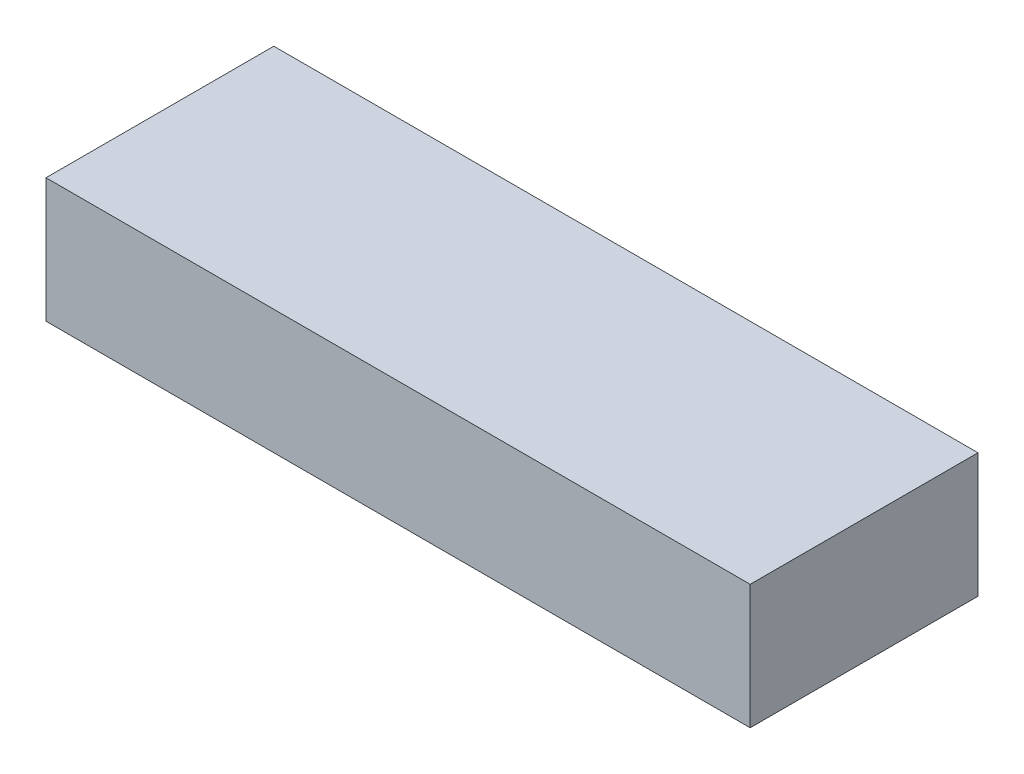
ISO-10303-21;
HEADER;
FILE_DESCRIPTION(('STEP AP214'),'2;1');
FILE_NAME('part.step','',(''),(''),'','','');
FILE_SCHEMA(('AUTOMOTIVE_DESIGN { 1 0 10303 214 1 1 1 1 }'));
ENDSEC;
DATA;
#1=APPLICATION_CONTEXT('core data for automotive mechanical design processes');
#2=APPLICATION_PROTOCOL_DEFINITION('international standard','automotive_design',2000,#1);
#3=PRODUCT_CONTEXT('',#1,'mechanical');
#4=PRODUCT('Part','Part','',(#3));
#5=PRODUCT_RELATED_PRODUCT_CATEGORY('part','',(#4));
#6=PRODUCT_DEFINITION_FORMATION('','',#4);
#7=PRODUCT_DEFINITION_CONTEXT('part definition',#1,'design');
#8=PRODUCT_DEFINITION('design','',#6,#7);
#9=PRODUCT_DEFINITION_SHAPE('','',#8);
#10=(LENGTH_UNIT() NAMED_UNIT(*) SI_UNIT(.MILLI.,.METRE.));
#11=(NAMED_UNIT(*) PLANE_ANGLE_UNIT() SI_UNIT($,.RADIAN.));
#12=(NAMED_UNIT(*) SI_UNIT($,.STERADIAN.) SOLID_ANGLE_UNIT());
#13=UNCERTAINTY_MEASURE_WITH_UNIT(LENGTH_MEASURE(1.E-05),#10,'distance_accuracy_value','');
#14=(GEOMETRIC_REPRESENTATION_CONTEXT(3) GLOBAL_UNCERTAINTY_ASSIGNED_CONTEXT((#13)) GLOBAL_UNIT_ASSIGNED_CONTEXT((#10,
#11,#12)) REPRESENTATION_CONTEXT('',''));
#15=CARTESIAN_POINT('',(0.,0.,0.));
#16=DIRECTION('',(0.,0.,1.));
#17=DIRECTION('',(1.,0.,0.));
#18=AXIS2_PLACEMENT_3D('',#15,#16,#17);
#19=CARTESIAN_POINT('',(-60.7043873312565,24.,-34.5666666666667));
#20=DIRECTION('',(1.,0.,0.));
#21=DIRECTION('',(0.,0.,-1.));
#22=AXIS2_PLACEMENT_3D('',#19,#20,#21);
#23=PLANE('',#22);
#24=DIRECTION('',(0.,0.,1.));
#25=VECTOR('',#24,1.);
#26=CARTESIAN_POINT('',(-60.7043873312565,0.,-34.5666666666667));
#27=LINE('',#26,#25);
#28=CARTESIAN_POINT('',(-60.7043873312565,0.,-34.5666666666667));
#29=VERTEX_POINT('',#28);
#30=CARTESIAN_POINT('',(-60.7043873312564,0.,9.43333333333332));
#31=VERTEX_POINT('',#30);
#32=EDGE_CURVE('E104',#29,#31,#27,.T.);
#33=ORIENTED_EDGE('',*,*,#32,.T.);
#34=DIRECTION('',(0.,-1.,0.));
#35=VECTOR('',#34,1.);
#36=CARTESIAN_POINT('',(-60.7043873312564,24.,9.43333333333332));
#37=LINE('',#36,#35);
#38=CARTESIAN_POINT('',(-60.7043873312564,24.,9.43333333333332));
#39=VERTEX_POINT('',#38);
#40=EDGE_CURVE('E11',#39,#31,#37,.T.);
#41=ORIENTED_EDGE('',*,*,#40,.F.);
#42=DIRECTION('',(0.,0.,1.));
#43=VECTOR('',#42,1.);
#44=CARTESIAN_POINT('',(-60.7043873312565,24.,-34.5666666666667));
#45=LINE('',#44,#43);
#46=CARTESIAN_POINT('',(-60.7043873312565,24.,-34.5666666666667));
#47=VERTEX_POINT('',#46);
#48=EDGE_CURVE('E92',#47,#39,#45,.T.);
#49=ORIENTED_EDGE('',*,*,#48,.F.);
#50=DIRECTION('',(0.,-1.,0.));
#51=VECTOR('',#50,1.);
#52=CARTESIAN_POINT('',(-60.7043873312565,24.,-34.5666666666667));
#53=LINE('',#52,#51);
#54=EDGE_CURVE('E100',#47,#29,#53,.T.);
#55=ORIENTED_EDGE('',*,*,#54,.T.);
#56=EDGE_LOOP('',(#33,#41,#49,#55));
#57=FACE_BOUND('',#56,.T.);
#58=ADVANCED_FACE('F41',(#57),#23,.F.);
#59=CARTESIAN_POINT('',(-60.7043873312564,24.,9.43333333333332));
#60=DIRECTION('',(0.,0.,-1.));
#61=DIRECTION('',(-1.,0.,0.));
#62=AXIS2_PLACEMENT_3D('',#59,#60,#61);
#63=PLANE('',#62);
#64=DIRECTION('',(1.,0.,0.));
#65=VECTOR('',#64,1.);
#66=CARTESIAN_POINT('',(-60.7043873312564,0.,9.43333333333332));
#67=LINE('',#66,#65);
#68=CARTESIAN_POINT('',(75.2956126687435,0.,9.43333333333332));
#69=VERTEX_POINT('',#68);
#70=EDGE_CURVE('E96',#31,#69,#67,.T.);
#71=ORIENTED_EDGE('',*,*,#70,.T.);
#72=DIRECTION('',(0.,-1.,0.));
#73=VECTOR('',#72,1.);
#74=CARTESIAN_POINT('',(75.2956126687435,24.,9.43333333333332));
#75=LINE('',#74,#73);
#76=CARTESIAN_POINT('',(75.2956126687435,24.,9.43333333333332));
#77=VERTEX_POINT('',#76);
#78=EDGE_CURVE('E49',#77,#69,#75,.T.);
#79=ORIENTED_EDGE('',*,*,#78,.F.);
#80=DIRECTION('',(1.,0.,0.));
#81=VECTOR('',#80,1.);
#82=CARTESIAN_POINT('',(-60.7043873312564,24.,9.43333333333332));
#83=LINE('',#82,#81);
#84=EDGE_CURVE('E87',#39,#77,#83,.T.);
#85=ORIENTED_EDGE('',*,*,#84,.F.);
#86=ORIENTED_EDGE('',*,*,#40,.T.);
#87=EDGE_LOOP('',(#71,#79,#85,#86));
#88=FACE_BOUND('',#87,.T.);
#89=ADVANCED_FACE('F95',(#88),#63,.F.);
#90=CARTESIAN_POINT('',(75.2956126687435,24.,-34.5666666666667));
#91=DIRECTION('',(-1.,0.,0.));
#92=DIRECTION('',(0.,0.,1.));
#93=AXIS2_PLACEMENT_3D('',#90,#91,#92);
#94=PLANE('',#93);
#95=DIRECTION('',(0.,0.,-1.));
#96=VECTOR('',#95,1.);
#97=CARTESIAN_POINT('',(75.2956126687435,0.,-34.5666666666667));
#98=LINE('',#97,#96);
#99=CARTESIAN_POINT('',(75.2956126687435,0.,-34.5666666666667));
#100=VERTEX_POINT('',#99);
#101=EDGE_CURVE('E74',#69,#100,#98,.T.);
#102=ORIENTED_EDGE('',*,*,#101,.T.);
#103=DIRECTION('',(0.,-1.,0.));
#104=VECTOR('',#103,1.);
#105=CARTESIAN_POINT('',(75.2956126687435,24.,-34.5666666666667));
#106=LINE('',#105,#104);
#107=CARTESIAN_POINT('',(75.2956126687435,24.,-34.5666666666667));
#108=VERTEX_POINT('',#107);
#109=EDGE_CURVE('E97',#108,#100,#106,.T.);
#110=ORIENTED_EDGE('',*,*,#109,.F.);
#111=DIRECTION('',(0.,0.,-1.));
#112=VECTOR('',#111,1.);
#113=CARTESIAN_POINT('',(75.2956126687435,24.,-34.5666666666667));
#114=LINE('',#113,#112);
#115=EDGE_CURVE('E90',#77,#108,#114,.T.);
#116=ORIENTED_EDGE('',*,*,#115,.F.);
#117=ORIENTED_EDGE('',*,*,#78,.T.);
#118=EDGE_LOOP('',(#102,#110,#116,#117));
#119=FACE_BOUND('',#118,.T.);
#120=ADVANCED_FACE('F98',(#119),#94,.F.);
#121=CARTESIAN_POINT('',(-60.7043873312565,24.,-34.5666666666667));
#122=DIRECTION('',(0.,0.,1.));
#123=DIRECTION('',(1.,0.,0.));
#124=AXIS2_PLACEMENT_3D('',#121,#122,#123);
#125=PLANE('',#124);
#126=DIRECTION('',(-1.,0.,0.));
#127=VECTOR('',#126,1.);
#128=CARTESIAN_POINT('',(-60.7043873312565,0.,-34.5666666666667));
#129=LINE('',#128,#127);
#130=EDGE_CURVE('E80',#100,#29,#129,.T.);
#131=ORIENTED_EDGE('',*,*,#130,.T.);
#132=ORIENTED_EDGE('',*,*,#54,.F.);
#133=DIRECTION('',(-1.,0.,0.));
#134=VECTOR('',#133,1.);
#135=CARTESIAN_POINT('',(-60.7043873312565,24.,-34.5666666666667));
#136=LINE('',#135,#134);
#137=EDGE_CURVE('E57',#108,#47,#136,.T.);
#138=ORIENTED_EDGE('',*,*,#137,.F.);
#139=ORIENTED_EDGE('',*,*,#109,.T.);
#140=EDGE_LOOP('',(#131,#132,#138,#139));
#141=FACE_BOUND('',#140,.T.);
#142=ADVANCED_FACE('F111',(#141),#125,.F.);
#143=CARTESIAN_POINT('',(0.,24.,0.));
#144=DIRECTION('',(0.,1.,0.));
#145=DIRECTION('',(0.,0.,1.));
#146=AXIS2_PLACEMENT_3D('',#143,#144,#145);
#147=PLANE('',#146);
#148=ORIENTED_EDGE('',*,*,#48,.T.);
#149=ORIENTED_EDGE('',*,*,#84,.T.);
#150=ORIENTED_EDGE('',*,*,#115,.T.);
#151=ORIENTED_EDGE('',*,*,#137,.T.);
#152=EDGE_LOOP('',(#148,#149,#150,#151));
#153=FACE_BOUND('',#152,.T.);
#154=ADVANCED_FACE('F88',(#153),#147,.T.);
#155=CARTESIAN_POINT('',(0.,0.,0.));
#156=DIRECTION('',(0.,1.,0.));
#157=DIRECTION('',(0.,0.,1.));
#158=AXIS2_PLACEMENT_3D('',#155,#156,#157);
#159=PLANE('',#158);
#160=ORIENTED_EDGE('',*,*,#32,.F.);
#161=ORIENTED_EDGE('',*,*,#130,.F.);
#162=ORIENTED_EDGE('',*,*,#101,.F.);
#163=ORIENTED_EDGE('',*,*,#70,.F.);
#164=EDGE_LOOP('',(#160,#161,#162,#163));
#165=FACE_BOUND('',#164,.T.);
#166=ADVANCED_FACE('F114',(#165),#159,.F.);
#167=CLOSED_SHELL('',(#58,#89,#120,#142,#154,#166));
#168=MANIFOLD_SOLID_BREP('B2',#167);
#169=ADVANCED_BREP_SHAPE_REPRESENTATION('',(#18,#168),#14);
#170=SHAPE_DEFINITION_REPRESENTATION(#9,#169);
ENDSEC;
END-ISO-10303-21;
